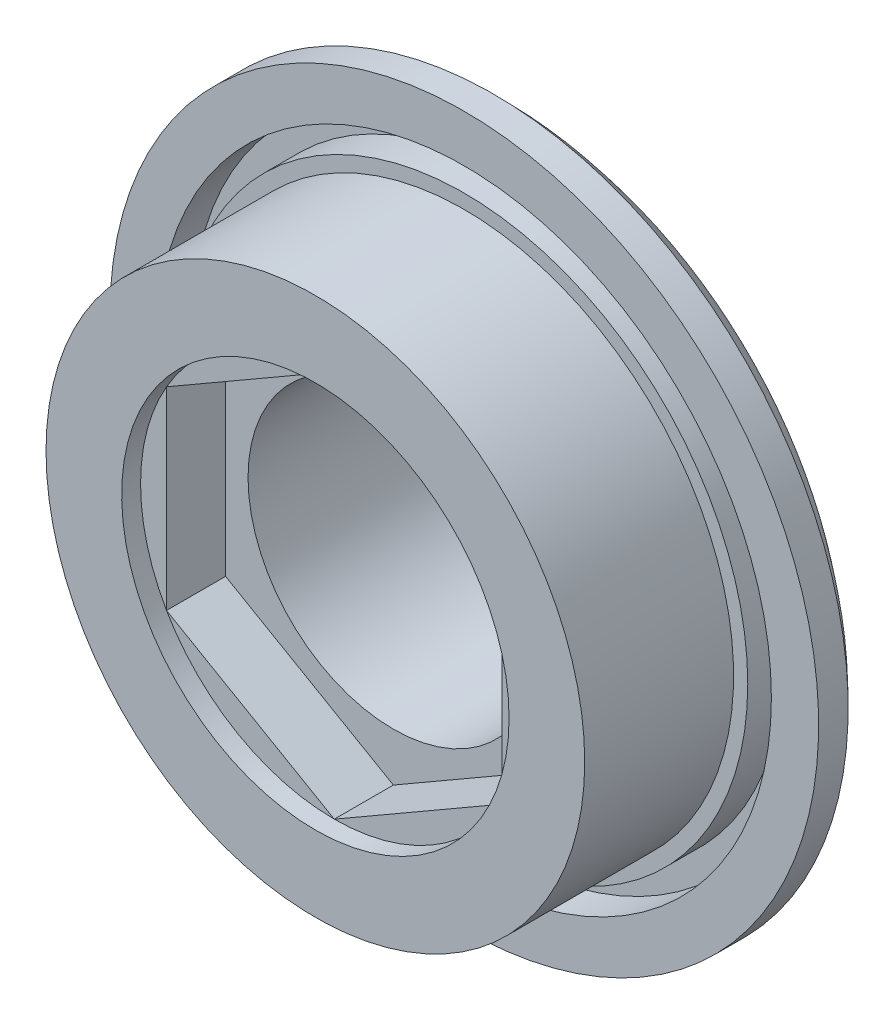
ISO-10303-21;
HEADER;
FILE_DESCRIPTION(('STEP AP214'),'2;1');
FILE_NAME('part.step','',(''),(''),'','','');
FILE_SCHEMA(('AUTOMOTIVE_DESIGN { 1 0 10303 214 1 1 1 1 }'));
ENDSEC;
DATA;
#1=APPLICATION_CONTEXT('core data for automotive mechanical design processes');
#2=APPLICATION_PROTOCOL_DEFINITION('international standard','automotive_design',2000,#1);
#3=PRODUCT_CONTEXT('',#1,'mechanical');
#4=PRODUCT('Part','Part','',(#3));
#5=PRODUCT_RELATED_PRODUCT_CATEGORY('part','',(#4));
#6=PRODUCT_DEFINITION_FORMATION('','',#4);
#7=PRODUCT_DEFINITION_CONTEXT('part definition',#1,'design');
#8=PRODUCT_DEFINITION('design','',#6,#7);
#9=PRODUCT_DEFINITION_SHAPE('','',#8);
#10=(LENGTH_UNIT() NAMED_UNIT(*) SI_UNIT(.MILLI.,.METRE.));
#11=(NAMED_UNIT(*) PLANE_ANGLE_UNIT() SI_UNIT($,.RADIAN.));
#12=(NAMED_UNIT(*) SI_UNIT($,.STERADIAN.) SOLID_ANGLE_UNIT());
#13=UNCERTAINTY_MEASURE_WITH_UNIT(LENGTH_MEASURE(1.E-05),#10,'distance_accuracy_value','');
#14=(GEOMETRIC_REPRESENTATION_CONTEXT(3) GLOBAL_UNCERTAINTY_ASSIGNED_CONTEXT((#13)) GLOBAL_UNIT_ASSIGNED_CONTEXT((#10,
#11,#12)) REPRESENTATION_CONTEXT('',''));
#15=CARTESIAN_POINT('',(0.,0.,0.));
#16=DIRECTION('',(0.,0.,1.));
#17=DIRECTION('',(1.,0.,0.));
#18=AXIS2_PLACEMENT_3D('',#15,#16,#17);
#19=CARTESIAN_POINT('',(15.,0.,4.25));
#20=DIRECTION('',(0.,0.,-1.));
#21=DIRECTION('',(-1.,0.,0.));
#22=AXIS2_PLACEMENT_3D('',#19,#20,#21);
#23=PLANE('',#22);
#24=CARTESIAN_POINT('',(0.,0.,4.25));
#25=DIRECTION('',(0.,0.,-1.));
#26=DIRECTION('',(-1.,0.,0.));
#27=AXIS2_PLACEMENT_3D('',#24,#25,#26);
#28=CIRCLE('',#27,11.4);
#29=CARTESIAN_POINT('',(-11.4,0.,4.25));
#30=VERTEX_POINT('',#29);
#31=EDGE_CURVE('E164',#30,#30,#28,.T.);
#32=ORIENTED_EDGE('',*,*,#31,.T.);
#33=EDGE_LOOP('',(#32));
#34=FACE_BOUND('',#33,.T.);
#35=CARTESIAN_POINT('',(0.,0.,4.25));
#36=DIRECTION('',(0.,0.,1.));
#37=DIRECTION('',(1.,0.,0.));
#38=AXIS2_PLACEMENT_3D('',#35,#36,#37);
#39=CIRCLE('',#38,12.);
#40=CARTESIAN_POINT('',(12.,0.,4.25));
#41=VERTEX_POINT('',#40);
#42=EDGE_CURVE('E200',#41,#41,#39,.T.);
#43=ORIENTED_EDGE('',*,*,#42,.T.);
#44=EDGE_LOOP('',(#43));
#45=FACE_BOUND('',#44,.T.);
#46=ADVANCED_FACE('F41',(#34,#45),#23,.F.);
#47=CARTESIAN_POINT('',(6.15,0.,9.75));
#48=DIRECTION('',(0.,0.,1.));
#49=DIRECTION('',(1.,0.,0.));
#50=AXIS2_PLACEMENT_3D('',#47,#48,#49);
#51=PLANE('',#50);
#52=DIRECTION('',(0.866025403784439,-0.5,0.));
#53=VECTOR('',#52,1.);
#54=CARTESIAN_POINT('',(7.1,4.09918691124634,9.75));
#55=LINE('',#54,#53);
#56=CARTESIAN_POINT('',(0.,8.19837382249269,9.75));
#57=VERTEX_POINT('',#56);
#58=CARTESIAN_POINT('',(7.1,4.09918691124634,9.75));
#59=VERTEX_POINT('',#58);
#60=EDGE_CURVE('E105',#57,#59,#55,.T.);
#61=ORIENTED_EDGE('',*,*,#60,.T.);
#62=CARTESIAN_POINT('',(0.,0.,9.75));
#63=DIRECTION('',(0.,0.,1.));
#64=DIRECTION('',(1.,0.,0.));
#65=AXIS2_PLACEMENT_3D('',#62,#63,#64);
#66=CIRCLE('',#65,8.19837382249269);
#67=EDGE_CURVE('E53',#59,#57,#66,.T.);
#68=ORIENTED_EDGE('',*,*,#67,.T.);
#69=EDGE_LOOP('',(#61,#68));
#70=FACE_BOUND('',#69,.T.);
#71=ADVANCED_FACE('F103',(#70),#51,.T.);
#72=DIRECTION('',(0.866025403784439,0.5,0.));
#73=VECTOR('',#72,1.);
#74=CARTESIAN_POINT('',(0.,8.19837382249269,9.75));
#75=LINE('',#74,#73);
#76=CARTESIAN_POINT('',(-7.1,4.09918691124635,9.75));
#77=VERTEX_POINT('',#76);
#78=EDGE_CURVE('E112',#77,#57,#75,.T.);
#79=ORIENTED_EDGE('',*,*,#78,.T.);
#80=EDGE_CURVE('E12',#57,#77,#66,.T.);
#81=ORIENTED_EDGE('',*,*,#80,.T.);
#82=EDGE_LOOP('',(#79,#81));
#83=FACE_BOUND('',#82,.T.);
#84=ADVANCED_FACE('F113',(#83),#51,.T.);
#85=DIRECTION('',(0.,1.,0.));
#86=VECTOR('',#85,1.);
#87=CARTESIAN_POINT('',(-7.1,4.09918691124634,9.75));
#88=LINE('',#87,#86);
#89=CARTESIAN_POINT('',(-7.1,-4.09918691124635,9.75));
#90=VERTEX_POINT('',#89);
#91=EDGE_CURVE('E118',#90,#77,#88,.T.);
#92=ORIENTED_EDGE('',*,*,#91,.T.);
#93=EDGE_CURVE('E51',#77,#90,#66,.T.);
#94=ORIENTED_EDGE('',*,*,#93,.T.);
#95=EDGE_LOOP('',(#92,#94));
#96=FACE_BOUND('',#95,.T.);
#97=ADVANCED_FACE('F249',(#96),#51,.T.);
#98=DIRECTION('',(-0.866025403784439,0.5,0.));
#99=VECTOR('',#98,1.);
#100=CARTESIAN_POINT('',(-7.1,-4.09918691124634,9.75));
#101=LINE('',#100,#99);
#102=CARTESIAN_POINT('',(0.,-8.19837382249269,9.75));
#103=VERTEX_POINT('',#102);
#104=EDGE_CURVE('E144',#103,#90,#101,.T.);
#105=ORIENTED_EDGE('',*,*,#104,.T.);
#106=EDGE_CURVE('E250',#90,#103,#66,.T.);
#107=ORIENTED_EDGE('',*,*,#106,.T.);
#108=EDGE_LOOP('',(#105,#107));
#109=FACE_BOUND('',#108,.T.);
#110=ADVANCED_FACE('F253',(#109),#51,.T.);
#111=DIRECTION('',(-0.866025403784439,-0.5,0.));
#112=VECTOR('',#111,1.);
#113=CARTESIAN_POINT('',(0.,-8.19837382249269,9.75));
#114=LINE('',#113,#112);
#115=CARTESIAN_POINT('',(7.1,-4.09918691124634,9.75));
#116=VERTEX_POINT('',#115);
#117=EDGE_CURVE('E45',#116,#103,#114,.T.);
#118=ORIENTED_EDGE('',*,*,#117,.T.);
#119=EDGE_CURVE('E256',#103,#116,#66,.T.);
#120=ORIENTED_EDGE('',*,*,#119,.T.);
#121=EDGE_LOOP('',(#118,#120));
#122=FACE_BOUND('',#121,.T.);
#123=ADVANCED_FACE('F260',(#122),#51,.T.);
#124=DIRECTION('',(0.,-1.,0.));
#125=VECTOR('',#124,1.);
#126=CARTESIAN_POINT('',(7.1,-4.09918691124634,9.75));
#127=LINE('',#126,#125);
#128=EDGE_CURVE('E125',#59,#116,#127,.T.);
#129=ORIENTED_EDGE('',*,*,#128,.T.);
#130=EDGE_CURVE('E110',#116,#59,#66,.T.);
#131=ORIENTED_EDGE('',*,*,#130,.T.);
#132=EDGE_LOOP('',(#129,#131));
#133=FACE_BOUND('',#132,.T.);
#134=ADVANCED_FACE('F195',(#133),#51,.T.);
#135=CARTESIAN_POINT('',(0.,0.,0.));
#136=DIRECTION('',(0.,0.,-1.));
#137=DIRECTION('',(-1.,0.,0.));
#138=AXIS2_PLACEMENT_3D('',#135,#136,#137);
#139=CYLINDRICAL_SURFACE('',#138,11.4);
#140=ORIENTED_EDGE('',*,*,#31,.F.);
#141=EDGE_LOOP('',(#140));
#142=FACE_BOUND('',#141,.T.);
#143=CARTESIAN_POINT('',(0.,0.,10.55));
#144=DIRECTION('',(0.,0.,1.));
#145=DIRECTION('',(1.,0.,0.));
#146=AXIS2_PLACEMENT_3D('',#143,#144,#145);
#147=CIRCLE('',#146,11.4);
#148=CARTESIAN_POINT('',(11.4,0.,10.55));
#149=VERTEX_POINT('',#148);
#150=EDGE_CURVE('E218',#149,#149,#147,.T.);
#151=ORIENTED_EDGE('',*,*,#150,.F.);
#152=EDGE_LOOP('',(#151));
#153=FACE_BOUND('',#152,.T.);
#154=ADVANCED_FACE('F291',(#142,#153),#139,.T.);
#155=CARTESIAN_POINT('',(-7.1,-4.09918691124634,-21.6908582894576));
#156=DIRECTION('',(-0.5,-0.866025403784438,0.));
#157=DIRECTION('',(0.866025403784439,-0.5,0.));
#158=AXIS2_PLACEMENT_3D('',#155,#156,#157);
#159=PLANE('',#158);
#160=ORIENTED_EDGE('',*,*,#104,.F.);
#161=DIRECTION('',(0.,0.,1.));
#162=VECTOR('',#161,1.);
#163=CARTESIAN_POINT('',(0.,-8.19837382249269,-21.6908582894576));
#164=LINE('',#163,#162);
#165=CARTESIAN_POINT('',(0.,-8.19837382249269,7.25));
#166=VERTEX_POINT('',#165);
#167=EDGE_CURVE('E140',#166,#103,#164,.T.);
#168=ORIENTED_EDGE('',*,*,#167,.F.);
#169=DIRECTION('',(-0.866025403784439,0.5,0.));
#170=VECTOR('',#169,1.);
#171=CARTESIAN_POINT('',(-7.1,-4.09918691124634,7.25));
#172=LINE('',#171,#170);
#173=CARTESIAN_POINT('',(-7.1,-4.09918691124634,7.25));
#174=VERTEX_POINT('',#173);
#175=EDGE_CURVE('E149',#166,#174,#172,.T.);
#176=ORIENTED_EDGE('',*,*,#175,.T.);
#177=DIRECTION('',(0.,0.,1.));
#178=VECTOR('',#177,1.);
#179=CARTESIAN_POINT('',(-7.1,-4.09918691124634,-21.6908582894576));
#180=LINE('',#179,#178);
#181=EDGE_CURVE('E132',#174,#90,#180,.T.);
#182=ORIENTED_EDGE('',*,*,#181,.T.);
#183=EDGE_LOOP('',(#160,#168,#176,#182));
#184=FACE_BOUND('',#183,.T.);
#185=ADVANCED_FACE('F241',(#184),#159,.F.);
#186=CARTESIAN_POINT('',(-7.1,4.09918691124634,-21.6908582894576));
#187=DIRECTION('',(-1.,0.,0.));
#188=DIRECTION('',(0.,0.,1.));
#189=AXIS2_PLACEMENT_3D('',#186,#187,#188);
#190=PLANE('',#189);
#191=ORIENTED_EDGE('',*,*,#91,.F.);
#192=ORIENTED_EDGE('',*,*,#181,.F.);
#193=DIRECTION('',(0.,1.,0.));
#194=VECTOR('',#193,1.);
#195=CARTESIAN_POINT('',(-7.1,4.09918691124634,7.25));
#196=LINE('',#195,#194);
#197=CARTESIAN_POINT('',(-7.1,4.09918691124635,7.25));
#198=VERTEX_POINT('',#197);
#199=EDGE_CURVE('E233',#174,#198,#196,.T.);
#200=ORIENTED_EDGE('',*,*,#199,.T.);
#201=DIRECTION('',(0.,0.,1.));
#202=VECTOR('',#201,1.);
#203=CARTESIAN_POINT('',(-7.1,4.09918691124634,-21.6908582894576));
#204=LINE('',#203,#202);
#205=EDGE_CURVE('E130',#198,#77,#204,.T.);
#206=ORIENTED_EDGE('',*,*,#205,.T.);
#207=EDGE_LOOP('',(#191,#192,#200,#206));
#208=FACE_BOUND('',#207,.T.);
#209=ADVANCED_FACE('F247',(#208),#190,.F.);
#210=CARTESIAN_POINT('',(0.,8.19837382249269,-21.6908582894576));
#211=DIRECTION('',(-0.5,0.866025403784439,0.));
#212=DIRECTION('',(-0.866025403784439,-0.5,0.));
#213=AXIS2_PLACEMENT_3D('',#210,#211,#212);
#214=PLANE('',#213);
#215=ORIENTED_EDGE('',*,*,#78,.F.);
#216=ORIENTED_EDGE('',*,*,#205,.F.);
#217=DIRECTION('',(0.866025403784439,0.5,0.));
#218=VECTOR('',#217,1.);
#219=CARTESIAN_POINT('',(0.,8.19837382249269,7.25));
#220=LINE('',#219,#218);
#221=CARTESIAN_POINT('',(0.,8.19837382249269,7.25));
#222=VERTEX_POINT('',#221);
#223=EDGE_CURVE('E129',#198,#222,#220,.T.);
#224=ORIENTED_EDGE('',*,*,#223,.T.);
#225=DIRECTION('',(0.,0.,1.));
#226=VECTOR('',#225,1.);
#227=CARTESIAN_POINT('',(0.,8.19837382249269,-21.6908582894576));
#228=LINE('',#227,#226);
#229=EDGE_CURVE('E121',#222,#57,#228,.T.);
#230=ORIENTED_EDGE('',*,*,#229,.T.);
#231=EDGE_LOOP('',(#215,#216,#224,#230));
#232=FACE_BOUND('',#231,.T.);
#233=ADVANCED_FACE('F127',(#232),#214,.F.);
#234=CARTESIAN_POINT('',(7.1,4.09918691124634,-21.6908582894576));
#235=DIRECTION('',(0.5,0.866025403784438,0.));
#236=DIRECTION('',(-0.866025403784439,0.5,0.));
#237=AXIS2_PLACEMENT_3D('',#234,#235,#236);
#238=PLANE('',#237);
#239=ORIENTED_EDGE('',*,*,#60,.F.);
#240=ORIENTED_EDGE('',*,*,#229,.F.);
#241=DIRECTION('',(0.866025403784439,-0.5,0.));
#242=VECTOR('',#241,1.);
#243=CARTESIAN_POINT('',(7.1,4.09918691124634,7.25));
#244=LINE('',#243,#242);
#245=CARTESIAN_POINT('',(7.1,4.09918691124634,7.25));
#246=VERTEX_POINT('',#245);
#247=EDGE_CURVE('E60',#222,#246,#244,.T.);
#248=ORIENTED_EDGE('',*,*,#247,.T.);
#249=DIRECTION('',(0.,0.,1.));
#250=VECTOR('',#249,1.);
#251=CARTESIAN_POINT('',(7.1,4.09918691124634,-21.6908582894576));
#252=LINE('',#251,#250);
#253=EDGE_CURVE('E123',#246,#59,#252,.T.);
#254=ORIENTED_EDGE('',*,*,#253,.T.);
#255=EDGE_LOOP('',(#239,#240,#248,#254));
#256=FACE_BOUND('',#255,.T.);
#257=ADVANCED_FACE('F120',(#256),#238,.F.);
#258=CARTESIAN_POINT('',(7.1,-4.09918691124634,-21.6908582894576));
#259=DIRECTION('',(1.,0.,0.));
#260=DIRECTION('',(0.,1.,0.));
#261=AXIS2_PLACEMENT_3D('',#258,#259,#260);
#262=PLANE('',#261);
#263=ORIENTED_EDGE('',*,*,#128,.F.);
#264=ORIENTED_EDGE('',*,*,#253,.F.);
#265=DIRECTION('',(0.,-1.,0.));
#266=VECTOR('',#265,1.);
#267=CARTESIAN_POINT('',(7.1,-4.09918691124634,7.25));
#268=LINE('',#267,#266);
#269=CARTESIAN_POINT('',(7.1,-4.09918691124634,7.24999999999999));
#270=VERTEX_POINT('',#269);
#271=EDGE_CURVE('E229',#246,#270,#268,.T.);
#272=ORIENTED_EDGE('',*,*,#271,.T.);
#273=DIRECTION('',(0.,0.,1.));
#274=VECTOR('',#273,1.);
#275=CARTESIAN_POINT('',(7.1,-4.09918691124634,-21.6908582894576));
#276=LINE('',#275,#274);
#277=EDGE_CURVE('E134',#270,#116,#276,.T.);
#278=ORIENTED_EDGE('',*,*,#277,.T.);
#279=EDGE_LOOP('',(#263,#264,#272,#278));
#280=FACE_BOUND('',#279,.T.);
#281=ADVANCED_FACE('F185',(#280),#262,.F.);
#282=CARTESIAN_POINT('',(0.,-8.19837382249269,-21.6908582894576));
#283=DIRECTION('',(0.5,-0.866025403784438,0.));
#284=DIRECTION('',(0.866025403784439,0.5,0.));
#285=AXIS2_PLACEMENT_3D('',#282,#283,#284);
#286=PLANE('',#285);
#287=ORIENTED_EDGE('',*,*,#117,.F.);
#288=ORIENTED_EDGE('',*,*,#277,.F.);
#289=DIRECTION('',(-0.866025403784439,-0.5,0.));
#290=VECTOR('',#289,1.);
#291=CARTESIAN_POINT('',(0.,-8.19837382249269,7.25));
#292=LINE('',#291,#290);
#293=EDGE_CURVE('E145',#270,#166,#292,.T.);
#294=ORIENTED_EDGE('',*,*,#293,.T.);
#295=ORIENTED_EDGE('',*,*,#167,.T.);
#296=EDGE_LOOP('',(#287,#288,#294,#295));
#297=FACE_BOUND('',#296,.T.);
#298=ADVANCED_FACE('F176',(#297),#286,.F.);
#299=CARTESIAN_POINT('',(0.,0.,0.));
#300=DIRECTION('',(0.,0.,-1.));
#301=DIRECTION('',(-1.,0.,0.));
#302=AXIS2_PLACEMENT_3D('',#299,#300,#301);
#303=CYLINDRICAL_SURFACE('',#302,6.15);
#304=CARTESIAN_POINT('',(0.,0.,0.));
#305=DIRECTION('',(0.,0.,-1.));
#306=DIRECTION('',(-1.,0.,0.));
#307=AXIS2_PLACEMENT_3D('',#304,#305,#306);
#308=CIRCLE('',#307,6.15);
#309=CARTESIAN_POINT('',(-6.15,0.,0.));
#310=VERTEX_POINT('',#309);
#311=EDGE_CURVE('E161',#310,#310,#308,.T.);
#312=ORIENTED_EDGE('',*,*,#311,.T.);
#313=EDGE_LOOP('',(#312));
#314=FACE_BOUND('',#313,.T.);
#315=CARTESIAN_POINT('',(0.,0.,7.25));
#316=DIRECTION('',(0.,0.,1.));
#317=DIRECTION('',(1.,0.,0.));
#318=AXIS2_PLACEMENT_3D('',#315,#316,#317);
#319=CIRCLE('',#318,6.15);
#320=CARTESIAN_POINT('',(6.15,0.,7.25));
#321=VERTEX_POINT('',#320);
#322=EDGE_CURVE('E148',#321,#321,#319,.F.);
#323=ORIENTED_EDGE('',*,*,#322,.F.);
#324=EDGE_LOOP('',(#323));
#325=FACE_BOUND('',#324,.T.);
#326=ADVANCED_FACE('F174',(#314,#325),#303,.F.);
#327=CARTESIAN_POINT('',(0.,0.,4.25));
#328=DIRECTION('',(0.,0.,1.));
#329=DIRECTION('',(1.,0.,0.));
#330=AXIS2_PLACEMENT_3D('',#327,#328,#329);
#331=CIRCLE('',#330,13.);
#332=CARTESIAN_POINT('',(13.,0.,4.25));
#333=VERTEX_POINT('',#332);
#334=EDGE_CURVE('E207',#333,#333,#331,.T.);
#335=ORIENTED_EDGE('',*,*,#334,.F.);
#336=EDGE_LOOP('',(#335));
#337=FACE_BOUND('',#336,.T.);
#338=CARTESIAN_POINT('',(0.,0.,4.25));
#339=DIRECTION('',(0.,0.,-1.));
#340=DIRECTION('',(-1.,0.,0.));
#341=AXIS2_PLACEMENT_3D('',#338,#339,#340);
#342=CIRCLE('',#341,15.);
#343=CARTESIAN_POINT('',(-15.,0.,4.25));
#344=VERTEX_POINT('',#343);
#345=EDGE_CURVE('E150',#344,#344,#342,.T.);
#346=ORIENTED_EDGE('',*,*,#345,.F.);
#347=EDGE_LOOP('',(#346));
#348=FACE_BOUND('',#347,.T.);
#349=ADVANCED_FACE('F43',(#337,#348),#23,.F.);
#350=CARTESIAN_POINT('',(6.15,0.,0.));
#351=DIRECTION('',(0.,0.,1.));
#352=DIRECTION('',(1.,0.,0.));
#353=AXIS2_PLACEMENT_3D('',#350,#351,#352);
#354=PLANE('',#353);
#355=ORIENTED_EDGE('',*,*,#311,.F.);
#356=EDGE_LOOP('',(#355));
#357=FACE_BOUND('',#356,.T.);
#358=CARTESIAN_POINT('',(0.,0.,0.));
#359=DIRECTION('',(0.,0.,-1.));
#360=DIRECTION('',(-1.,0.,0.));
#361=AXIS2_PLACEMENT_3D('',#358,#359,#360);
#362=CIRCLE('',#361,8.);
#363=CARTESIAN_POINT('',(-8.,0.,0.));
#364=VERTEX_POINT('',#363);
#365=EDGE_CURVE('E158',#364,#364,#362,.T.);
#366=ORIENTED_EDGE('',*,*,#365,.T.);
#367=EDGE_LOOP('',(#366));
#368=FACE_BOUND('',#367,.T.);
#369=ADVANCED_FACE('F183',(#357,#368),#354,.F.);
#370=CARTESIAN_POINT('',(0.,0.,9.66666666666667));
#371=DIRECTION('',(0.,0.,-1.));
#372=DIRECTION('',(-1.,0.,0.));
#373=AXIS2_PLACEMENT_3D('',#370,#371,#372);
#374=DEGENERATE_TOROIDAL_SURFACE('',#373,8.,9.66666666666667,.T.);
#375=ORIENTED_EDGE('',*,*,#365,.F.);
#376=EDGE_LOOP('',(#375));
#377=FACE_BOUND('',#376,.T.);
#378=CARTESIAN_POINT('',(0.,0.,3.));
#379=DIRECTION('',(0.,0.,-1.));
#380=DIRECTION('',(-1.,0.,0.));
#381=AXIS2_PLACEMENT_3D('',#378,#379,#380);
#382=CIRCLE('',#381,15.);
#383=CARTESIAN_POINT('',(-15.,0.,3.));
#384=VERTEX_POINT('',#383);
#385=EDGE_CURVE('E154',#384,#384,#382,.T.);
#386=ORIENTED_EDGE('',*,*,#385,.T.);
#387=EDGE_LOOP('',(#386));
#388=FACE_BOUND('',#387,.T.);
#389=ADVANCED_FACE('F278',(#377,#388),#374,.T.);
#390=CARTESIAN_POINT('',(0.,0.,0.));
#391=DIRECTION('',(0.,0.,-1.));
#392=DIRECTION('',(-1.,0.,0.));
#393=AXIS2_PLACEMENT_3D('',#390,#391,#392);
#394=CYLINDRICAL_SURFACE('',#393,15.);
#395=ORIENTED_EDGE('',*,*,#385,.F.);
#396=EDGE_LOOP('',(#395));
#397=FACE_BOUND('',#396,.T.);
#398=ORIENTED_EDGE('',*,*,#345,.T.);
#399=EDGE_LOOP('',(#398));
#400=FACE_BOUND('',#399,.T.);
#401=ADVANCED_FACE('F270',(#397,#400),#394,.T.);
#402=CARTESIAN_POINT('',(6.15,0.,7.25));
#403=DIRECTION('',(0.,0.,1.));
#404=DIRECTION('',(1.,0.,0.));
#405=AXIS2_PLACEMENT_3D('',#402,#403,#404);
#406=PLANE('',#405);
#407=ORIENTED_EDGE('',*,*,#175,.F.);
#408=ORIENTED_EDGE('',*,*,#293,.F.);
#409=ORIENTED_EDGE('',*,*,#271,.F.);
#410=ORIENTED_EDGE('',*,*,#247,.F.);
#411=ORIENTED_EDGE('',*,*,#223,.F.);
#412=ORIENTED_EDGE('',*,*,#199,.F.);
#413=EDGE_LOOP('',(#407,#408,#409,#410,#411,#412));
#414=FACE_BOUND('',#413,.T.);
#415=ORIENTED_EDGE('',*,*,#322,.T.);
#416=EDGE_LOOP('',(#415));
#417=FACE_BOUND('',#416,.T.);
#418=ADVANCED_FACE('F172',(#414,#417),#406,.T.);
#419=CARTESIAN_POINT('',(0.,0.,10.55));
#420=DIRECTION('',(0.,0.,1.));
#421=DIRECTION('',(1.,0.,0.));
#422=AXIS2_PLACEMENT_3D('',#419,#420,#421);
#423=PLANE('',#422);
#424=ORIENTED_EDGE('',*,*,#150,.T.);
#425=EDGE_LOOP('',(#424));
#426=FACE_BOUND('',#425,.T.);
#427=CARTESIAN_POINT('',(0.,0.,10.55));
#428=DIRECTION('',(0.,0.,1.));
#429=DIRECTION('',(1.,0.,0.));
#430=AXIS2_PLACEMENT_3D('',#427,#428,#429);
#431=CIRCLE('',#430,8.19837382249269);
#432=CARTESIAN_POINT('',(8.19837382249269,0.,10.55));
#433=VERTEX_POINT('',#432);
#434=EDGE_CURVE('E108',#433,#433,#431,.T.);
#435=ORIENTED_EDGE('',*,*,#434,.F.);
#436=EDGE_LOOP('',(#435));
#437=FACE_BOUND('',#436,.T.);
#438=ADVANCED_FACE('F269',(#426,#437),#423,.T.);
#439=CARTESIAN_POINT('',(0.,0.,10.55));
#440=DIRECTION('',(0.,0.,-1.));
#441=DIRECTION('',(-1.,0.,0.));
#442=AXIS2_PLACEMENT_3D('',#439,#440,#441);
#443=CYLINDRICAL_SURFACE('',#442,8.19837382249269);
#444=ORIENTED_EDGE('',*,*,#434,.T.);
#445=EDGE_LOOP('',(#444));
#446=FACE_BOUND('',#445,.T.);
#447=ORIENTED_EDGE('',*,*,#67,.F.);
#448=ORIENTED_EDGE('',*,*,#130,.F.);
#449=ORIENTED_EDGE('',*,*,#119,.F.);
#450=ORIENTED_EDGE('',*,*,#106,.F.);
#451=ORIENTED_EDGE('',*,*,#93,.F.);
#452=ORIENTED_EDGE('',*,*,#80,.F.);
#453=EDGE_LOOP('',(#447,#448,#449,#450,#451,#452));
#454=FACE_BOUND('',#453,.T.);
#455=ADVANCED_FACE('F95',(#446,#454),#443,.F.);
#456=CARTESIAN_POINT('',(0.,0.,2.75));
#457=DIRECTION('',(0.,0.,1.));
#458=DIRECTION('',(1.,0.,0.));
#459=AXIS2_PLACEMENT_3D('',#456,#457,#458);
#460=CYLINDRICAL_SURFACE('',#459,13.);
#461=CARTESIAN_POINT('',(0.,0.,2.75));
#462=DIRECTION('',(0.,0.,1.));
#463=DIRECTION('',(1.,0.,0.));
#464=AXIS2_PLACEMENT_3D('',#461,#462,#463);
#465=CIRCLE('',#464,13.);
#466=CARTESIAN_POINT('',(13.,0.,2.75));
#467=VERTEX_POINT('',#466);
#468=EDGE_CURVE('E109',#467,#467,#465,.T.);
#469=ORIENTED_EDGE('',*,*,#468,.F.);
#470=EDGE_LOOP('',(#469));
#471=FACE_BOUND('',#470,.T.);
#472=ORIENTED_EDGE('',*,*,#334,.T.);
#473=EDGE_LOOP('',(#472));
#474=FACE_BOUND('',#473,.T.);
#475=ADVANCED_FACE('F440',(#471,#474),#460,.F.);
#476=CARTESIAN_POINT('',(0.,0.,2.75));
#477=DIRECTION('',(0.,0.,1.));
#478=DIRECTION('',(1.,0.,0.));
#479=AXIS2_PLACEMENT_3D('',#476,#477,#478);
#480=PLANE('',#479);
#481=CARTESIAN_POINT('',(0.,0.,2.75));
#482=DIRECTION('',(0.,0.,1.));
#483=DIRECTION('',(1.,0.,0.));
#484=AXIS2_PLACEMENT_3D('',#481,#482,#483);
#485=CIRCLE('',#484,12.);
#486=CARTESIAN_POINT('',(12.,0.,2.75));
#487=VERTEX_POINT('',#486);
#488=EDGE_CURVE('E203',#487,#487,#485,.T.);
#489=ORIENTED_EDGE('',*,*,#488,.F.);
#490=EDGE_LOOP('',(#489));
#491=FACE_BOUND('',#490,.T.);
#492=ORIENTED_EDGE('',*,*,#468,.T.);
#493=EDGE_LOOP('',(#492));
#494=FACE_BOUND('',#493,.T.);
#495=ADVANCED_FACE('F452',(#491,#494),#480,.T.);
#496=CARTESIAN_POINT('',(0.,0.,2.75));
#497=DIRECTION('',(0.,0.,1.));
#498=DIRECTION('',(1.,0.,0.));
#499=AXIS2_PLACEMENT_3D('',#496,#497,#498);
#500=CYLINDRICAL_SURFACE('',#499,12.);
#501=ORIENTED_EDGE('',*,*,#488,.T.);
#502=EDGE_LOOP('',(#501));
#503=FACE_BOUND('',#502,.T.);
#504=ORIENTED_EDGE('',*,*,#42,.F.);
#505=EDGE_LOOP('',(#504));
#506=FACE_BOUND('',#505,.T.);
#507=ADVANCED_FACE('F461',(#503,#506),#500,.T.);
#508=CLOSED_SHELL('',(#46,#71,#84,#97,#110,#123,#134,#154,#185,#209,#233,#257,#281,#298,#326,
#349,#369,#389,#401,#418,#438,#455,#475,#495,#507));
#509=MANIFOLD_SOLID_BREP('B2',#508);
#510=ADVANCED_BREP_SHAPE_REPRESENTATION('',(#18,#509),#14);
#511=SHAPE_DEFINITION_REPRESENTATION(#9,#510);
ENDSEC;
END-ISO-10303-21;
